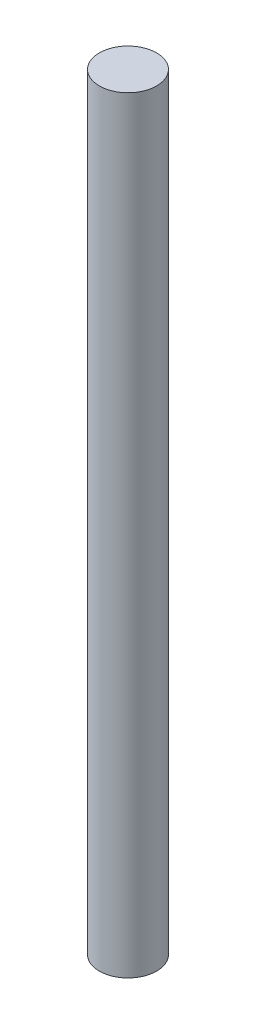
ISO-10303-21;
HEADER;
FILE_DESCRIPTION(('STEP AP214'),'2;1');
FILE_NAME('part.step','',(''),(''),'','','');
FILE_SCHEMA(('AUTOMOTIVE_DESIGN { 1 0 10303 214 1 1 1 1 }'));
ENDSEC;
DATA;
#1=APPLICATION_CONTEXT('core data for automotive mechanical design processes');
#2=APPLICATION_PROTOCOL_DEFINITION('international standard','automotive_design',2000,#1);
#3=PRODUCT_CONTEXT('',#1,'mechanical');
#4=PRODUCT('Part','Part','',(#3));
#5=PRODUCT_RELATED_PRODUCT_CATEGORY('part','',(#4));
#6=PRODUCT_DEFINITION_FORMATION('','',#4);
#7=PRODUCT_DEFINITION_CONTEXT('part definition',#1,'design');
#8=PRODUCT_DEFINITION('design','',#6,#7);
#9=PRODUCT_DEFINITION_SHAPE('','',#8);
#10=(LENGTH_UNIT() NAMED_UNIT(*) SI_UNIT(.MILLI.,.METRE.));
#11=(NAMED_UNIT(*) PLANE_ANGLE_UNIT() SI_UNIT($,.RADIAN.));
#12=(NAMED_UNIT(*) SI_UNIT($,.STERADIAN.) SOLID_ANGLE_UNIT());
#13=UNCERTAINTY_MEASURE_WITH_UNIT(LENGTH_MEASURE(1.E-05),#10,'distance_accuracy_value','');
#14=(GEOMETRIC_REPRESENTATION_CONTEXT(3) GLOBAL_UNCERTAINTY_ASSIGNED_CONTEXT((#13)) GLOBAL_UNIT_ASSIGNED_CONTEXT((#10,
#11,#12)) REPRESENTATION_CONTEXT('',''));
#15=CARTESIAN_POINT('',(0.,0.,0.));
#16=DIRECTION('',(0.,0.,1.));
#17=DIRECTION('',(1.,0.,0.));
#18=AXIS2_PLACEMENT_3D('',#15,#16,#17);
#19=CARTESIAN_POINT('',(0.,13.38,0.));
#20=DIRECTION('',(0.,-1.,0.));
#21=DIRECTION('',(0.,0.,-1.));
#22=AXIS2_PLACEMENT_3D('',#19,#20,#21);
#23=CYLINDRICAL_SURFACE('',#22,1.);
#24=CARTESIAN_POINT('',(0.,13.38,0.));
#25=DIRECTION('',(0.,1.,0.));
#26=DIRECTION('',(0.,0.,1.));
#27=AXIS2_PLACEMENT_3D('',#24,#25,#26);
#28=CIRCLE('',#27,1.);
#29=CARTESIAN_POINT('',(0.,13.38,1.));
#30=VERTEX_POINT('',#29);
#31=EDGE_CURVE('E10',#30,#30,#28,.T.);
#32=ORIENTED_EDGE('',*,*,#31,.F.);
#33=EDGE_LOOP('',(#32));
#34=FACE_BOUND('',#33,.T.);
#35=CARTESIAN_POINT('',(0.,-13.38,0.));
#36=DIRECTION('',(0.,1.,0.));
#37=DIRECTION('',(0.,0.,1.));
#38=AXIS2_PLACEMENT_3D('',#35,#36,#37);
#39=CIRCLE('',#38,1.);
#40=CARTESIAN_POINT('',(0.,-13.38,1.));
#41=VERTEX_POINT('',#40);
#42=EDGE_CURVE('E40',#41,#41,#39,.T.);
#43=ORIENTED_EDGE('',*,*,#42,.T.);
#44=EDGE_LOOP('',(#43));
#45=FACE_BOUND('',#44,.T.);
#46=ADVANCED_FACE('F37',(#34,#45),#23,.T.);
#47=CARTESIAN_POINT('',(0.,13.38,0.));
#48=DIRECTION('',(0.,1.,0.));
#49=DIRECTION('',(0.,0.,1.));
#50=AXIS2_PLACEMENT_3D('',#47,#48,#49);
#51=PLANE('',#50);
#52=ORIENTED_EDGE('',*,*,#31,.T.);
#53=EDGE_LOOP('',(#52));
#54=FACE_BOUND('',#53,.T.);
#55=ADVANCED_FACE('F52',(#54),#51,.T.);
#56=CARTESIAN_POINT('',(0.,-13.38,0.));
#57=DIRECTION('',(0.,1.,0.));
#58=DIRECTION('',(0.,0.,1.));
#59=AXIS2_PLACEMENT_3D('',#56,#57,#58);
#60=PLANE('',#59);
#61=ORIENTED_EDGE('',*,*,#42,.F.);
#62=EDGE_LOOP('',(#61));
#63=FACE_BOUND('',#62,.T.);
#64=ADVANCED_FACE('F50',(#63),#60,.F.);
#65=CLOSED_SHELL('',(#46,#55,#64));
#66=MANIFOLD_SOLID_BREP('B2',#65);
#67=ADVANCED_BREP_SHAPE_REPRESENTATION('',(#18,#66),#14);
#68=SHAPE_DEFINITION_REPRESENTATION(#9,#67);
ENDSEC;
END-ISO-10303-21;
